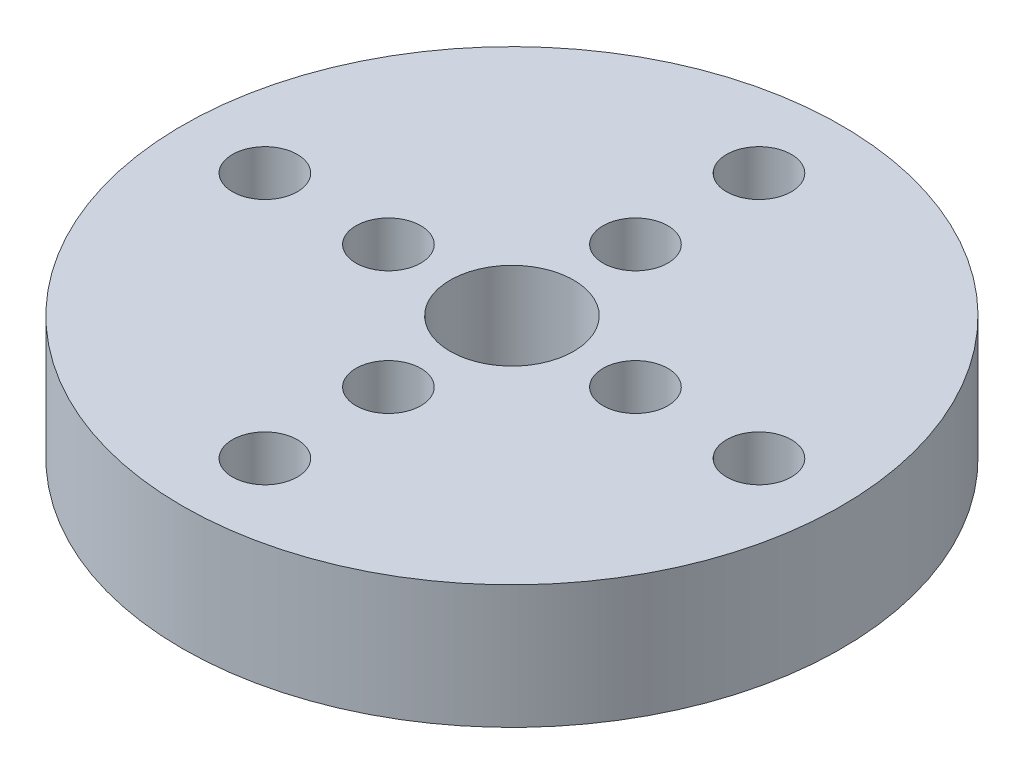
ISO-10303-21;
HEADER;
FILE_DESCRIPTION(('STEP AP214'),'2;1');
FILE_NAME('part.step','',(''),(''),'','','');
FILE_SCHEMA(('AUTOMOTIVE_DESIGN { 1 0 10303 214 1 1 1 1 }'));
ENDSEC;
DATA;
#1=APPLICATION_CONTEXT('core data for automotive mechanical design processes');
#2=APPLICATION_PROTOCOL_DEFINITION('international standard','automotive_design',2000,#1);
#3=PRODUCT_CONTEXT('',#1,'mechanical');
#4=PRODUCT('Part','Part','',(#3));
#5=PRODUCT_RELATED_PRODUCT_CATEGORY('part','',(#4));
#6=PRODUCT_DEFINITION_FORMATION('','',#4);
#7=PRODUCT_DEFINITION_CONTEXT('part definition',#1,'design');
#8=PRODUCT_DEFINITION('design','',#6,#7);
#9=PRODUCT_DEFINITION_SHAPE('','',#8);
#10=(LENGTH_UNIT() NAMED_UNIT(*) SI_UNIT(.MILLI.,.METRE.));
#11=(NAMED_UNIT(*) PLANE_ANGLE_UNIT() SI_UNIT($,.RADIAN.));
#12=(NAMED_UNIT(*) SI_UNIT($,.STERADIAN.) SOLID_ANGLE_UNIT());
#13=UNCERTAINTY_MEASURE_WITH_UNIT(LENGTH_MEASURE(1.E-05),#10,'distance_accuracy_value','');
#14=(GEOMETRIC_REPRESENTATION_CONTEXT(3) GLOBAL_UNCERTAINTY_ASSIGNED_CONTEXT((#13)) GLOBAL_UNIT_ASSIGNED_CONTEXT((#10,
#11,#12)) REPRESENTATION_CONTEXT('',''));
#15=CARTESIAN_POINT('',(0.,0.,0.));
#16=DIRECTION('',(0.,0.,1.));
#17=DIRECTION('',(1.,0.,0.));
#18=AXIS2_PLACEMENT_3D('',#15,#16,#17);
#19=CARTESIAN_POINT('',(0.,8.,0.));
#20=DIRECTION('',(0.,-1.,0.));
#21=DIRECTION('',(0.,0.,-1.));
#22=AXIS2_PLACEMENT_3D('',#19,#20,#21);
#23=CYLINDRICAL_SURFACE('',#22,21.345);
#24=CARTESIAN_POINT('',(0.,8.,0.));
#25=DIRECTION('',(0.,1.,0.));
#26=DIRECTION('',(0.,0.,1.));
#27=AXIS2_PLACEMENT_3D('',#24,#25,#26);
#28=CIRCLE('',#27,21.345);
#29=CARTESIAN_POINT('',(0.,8.,21.345));
#30=VERTEX_POINT('',#29);
#31=EDGE_CURVE('E10',#30,#30,#28,.T.);
#32=ORIENTED_EDGE('',*,*,#31,.F.);
#33=EDGE_LOOP('',(#32));
#34=FACE_BOUND('',#33,.T.);
#35=CARTESIAN_POINT('',(0.,0.,0.));
#36=DIRECTION('',(0.,1.,0.));
#37=DIRECTION('',(0.,0.,1.));
#38=AXIS2_PLACEMENT_3D('',#35,#36,#37);
#39=CIRCLE('',#38,21.345);
#40=CARTESIAN_POINT('',(0.,0.,21.345));
#41=VERTEX_POINT('',#40);
#42=EDGE_CURVE('E33',#41,#41,#39,.T.);
#43=ORIENTED_EDGE('',*,*,#42,.T.);
#44=EDGE_LOOP('',(#43));
#45=FACE_BOUND('',#44,.T.);
#46=ADVANCED_FACE('F30',(#34,#45),#23,.T.);
#47=CARTESIAN_POINT('',(0.,8.,0.));
#48=DIRECTION('',(0.,1.,0.));
#49=DIRECTION('',(0.,0.,1.));
#50=AXIS2_PLACEMENT_3D('',#47,#48,#49);
#51=PLANE('',#50);
#52=CARTESIAN_POINT('',(0.,8.,16.));
#53=DIRECTION('',(0.,1.,0.));
#54=DIRECTION('',(0.,0.,1.));
#55=AXIS2_PLACEMENT_3D('',#52,#53,#54);
#56=CIRCLE('',#55,2.1);
#57=CARTESIAN_POINT('',(0.,8.,18.1));
#58=VERTEX_POINT('',#57);
#59=EDGE_CURVE('E90',#58,#58,#56,.T.);
#60=ORIENTED_EDGE('',*,*,#59,.F.);
#61=EDGE_LOOP('',(#60));
#62=FACE_BOUND('',#61,.T.);
#63=CARTESIAN_POINT('',(0.,8.,8.));
#64=DIRECTION('',(0.,1.,0.));
#65=DIRECTION('',(0.,0.,1.));
#66=AXIS2_PLACEMENT_3D('',#63,#64,#65);
#67=CIRCLE('',#66,2.1);
#68=CARTESIAN_POINT('',(0.,8.,10.1));
#69=VERTEX_POINT('',#68);
#70=EDGE_CURVE('E84',#69,#69,#67,.T.);
#71=ORIENTED_EDGE('',*,*,#70,.F.);
#72=EDGE_LOOP('',(#71));
#73=FACE_BOUND('',#72,.T.);
#74=CARTESIAN_POINT('',(-16.,8.,0.));
#75=DIRECTION('',(0.,1.,0.));
#76=DIRECTION('',(0.,0.,1.));
#77=AXIS2_PLACEMENT_3D('',#74,#75,#76);
#78=CIRCLE('',#77,2.1);
#79=CARTESIAN_POINT('',(-16.,8.,2.1));
#80=VERTEX_POINT('',#79);
#81=EDGE_CURVE('E78',#80,#80,#78,.T.);
#82=ORIENTED_EDGE('',*,*,#81,.F.);
#83=EDGE_LOOP('',(#82));
#84=FACE_BOUND('',#83,.T.);
#85=CARTESIAN_POINT('',(-8.,8.,0.));
#86=DIRECTION('',(0.,1.,0.));
#87=DIRECTION('',(0.,0.,1.));
#88=AXIS2_PLACEMENT_3D('',#85,#86,#87);
#89=CIRCLE('',#88,2.1);
#90=CARTESIAN_POINT('',(-8.,8.,2.1));
#91=VERTEX_POINT('',#90);
#92=EDGE_CURVE('E72',#91,#91,#89,.T.);
#93=ORIENTED_EDGE('',*,*,#92,.F.);
#94=EDGE_LOOP('',(#93));
#95=FACE_BOUND('',#94,.T.);
#96=CARTESIAN_POINT('',(8.,8.,0.));
#97=DIRECTION('',(0.,1.,0.));
#98=DIRECTION('',(0.,0.,1.));
#99=AXIS2_PLACEMENT_3D('',#96,#97,#98);
#100=CIRCLE('',#99,2.1);
#101=CARTESIAN_POINT('',(8.,8.,2.1));
#102=VERTEX_POINT('',#101);
#103=EDGE_CURVE('E66',#102,#102,#100,.T.);
#104=ORIENTED_EDGE('',*,*,#103,.F.);
#105=EDGE_LOOP('',(#104));
#106=FACE_BOUND('',#105,.T.);
#107=CARTESIAN_POINT('',(16.,8.,0.));
#108=DIRECTION('',(0.,1.,0.));
#109=DIRECTION('',(0.,0.,1.));
#110=AXIS2_PLACEMENT_3D('',#107,#108,#109);
#111=CIRCLE('',#110,2.1);
#112=CARTESIAN_POINT('',(16.,8.,2.1));
#113=VERTEX_POINT('',#112);
#114=EDGE_CURVE('E60',#113,#113,#111,.T.);
#115=ORIENTED_EDGE('',*,*,#114,.F.);
#116=EDGE_LOOP('',(#115));
#117=FACE_BOUND('',#116,.T.);
#118=CARTESIAN_POINT('',(0.,8.,-16.));
#119=DIRECTION('',(0.,1.,0.));
#120=DIRECTION('',(0.,0.,1.));
#121=AXIS2_PLACEMENT_3D('',#118,#119,#120);
#122=CIRCLE('',#121,2.1);
#123=CARTESIAN_POINT('',(0.,8.,-13.9));
#124=VERTEX_POINT('',#123);
#125=EDGE_CURVE('E54',#124,#124,#122,.T.);
#126=ORIENTED_EDGE('',*,*,#125,.F.);
#127=EDGE_LOOP('',(#126));
#128=FACE_BOUND('',#127,.T.);
#129=CARTESIAN_POINT('',(0.,8.,-8.));
#130=DIRECTION('',(0.,1.,0.));
#131=DIRECTION('',(0.,0.,1.));
#132=AXIS2_PLACEMENT_3D('',#129,#130,#131);
#133=CIRCLE('',#132,2.1);
#134=CARTESIAN_POINT('',(0.,8.,-5.9));
#135=VERTEX_POINT('',#134);
#136=EDGE_CURVE('E48',#135,#135,#133,.T.);
#137=ORIENTED_EDGE('',*,*,#136,.F.);
#138=EDGE_LOOP('',(#137));
#139=FACE_BOUND('',#138,.T.);
#140=CARTESIAN_POINT('',(0.,8.,0.));
#141=DIRECTION('',(0.,1.,0.));
#142=DIRECTION('',(0.,0.,1.));
#143=AXIS2_PLACEMENT_3D('',#140,#141,#142);
#144=CIRCLE('',#143,4.);
#145=CARTESIAN_POINT('',(0.,8.,4.));
#146=VERTEX_POINT('',#145);
#147=EDGE_CURVE('E42',#146,#146,#144,.T.);
#148=ORIENTED_EDGE('',*,*,#147,.F.);
#149=EDGE_LOOP('',(#148));
#150=FACE_BOUND('',#149,.T.);
#151=ORIENTED_EDGE('',*,*,#31,.T.);
#152=EDGE_LOOP('',(#151));
#153=FACE_BOUND('',#152,.T.);
#154=ADVANCED_FACE('F106',(#62,#73,#84,#95,#106,#117,#128,#139,#150,#153),#51,.T.);
#155=CARTESIAN_POINT('',(0.,0.,0.));
#156=DIRECTION('',(0.,1.,0.));
#157=DIRECTION('',(0.,0.,1.));
#158=AXIS2_PLACEMENT_3D('',#155,#156,#157);
#159=PLANE('',#158);
#160=CARTESIAN_POINT('',(0.,0.,16.));
#161=DIRECTION('',(0.,1.,0.));
#162=DIRECTION('',(0.,0.,1.));
#163=AXIS2_PLACEMENT_3D('',#160,#161,#162);
#164=CIRCLE('',#163,2.1);
#165=CARTESIAN_POINT('',(0.,0.,18.1));
#166=VERTEX_POINT('',#165);
#167=EDGE_CURVE('E87',#166,#166,#164,.T.);
#168=ORIENTED_EDGE('',*,*,#167,.T.);
#169=EDGE_LOOP('',(#168));
#170=FACE_BOUND('',#169,.T.);
#171=CARTESIAN_POINT('',(0.,0.,8.));
#172=DIRECTION('',(0.,1.,0.));
#173=DIRECTION('',(0.,0.,1.));
#174=AXIS2_PLACEMENT_3D('',#171,#172,#173);
#175=CIRCLE('',#174,2.1);
#176=CARTESIAN_POINT('',(0.,0.,10.1));
#177=VERTEX_POINT('',#176);
#178=EDGE_CURVE('E81',#177,#177,#175,.T.);
#179=ORIENTED_EDGE('',*,*,#178,.T.);
#180=EDGE_LOOP('',(#179));
#181=FACE_BOUND('',#180,.T.);
#182=CARTESIAN_POINT('',(-16.,0.,0.));
#183=DIRECTION('',(0.,1.,0.));
#184=DIRECTION('',(0.,0.,1.));
#185=AXIS2_PLACEMENT_3D('',#182,#183,#184);
#186=CIRCLE('',#185,2.1);
#187=CARTESIAN_POINT('',(-16.,0.,2.1));
#188=VERTEX_POINT('',#187);
#189=EDGE_CURVE('E75',#188,#188,#186,.T.);
#190=ORIENTED_EDGE('',*,*,#189,.T.);
#191=EDGE_LOOP('',(#190));
#192=FACE_BOUND('',#191,.T.);
#193=CARTESIAN_POINT('',(-8.,0.,0.));
#194=DIRECTION('',(0.,1.,0.));
#195=DIRECTION('',(0.,0.,1.));
#196=AXIS2_PLACEMENT_3D('',#193,#194,#195);
#197=CIRCLE('',#196,2.1);
#198=CARTESIAN_POINT('',(-8.,0.,2.1));
#199=VERTEX_POINT('',#198);
#200=EDGE_CURVE('E69',#199,#199,#197,.T.);
#201=ORIENTED_EDGE('',*,*,#200,.T.);
#202=EDGE_LOOP('',(#201));
#203=FACE_BOUND('',#202,.T.);
#204=CARTESIAN_POINT('',(8.,0.,0.));
#205=DIRECTION('',(0.,1.,0.));
#206=DIRECTION('',(0.,0.,1.));
#207=AXIS2_PLACEMENT_3D('',#204,#205,#206);
#208=CIRCLE('',#207,2.1);
#209=CARTESIAN_POINT('',(8.,0.,2.1));
#210=VERTEX_POINT('',#209);
#211=EDGE_CURVE('E63',#210,#210,#208,.T.);
#212=ORIENTED_EDGE('',*,*,#211,.T.);
#213=EDGE_LOOP('',(#212));
#214=FACE_BOUND('',#213,.T.);
#215=CARTESIAN_POINT('',(16.,0.,0.));
#216=DIRECTION('',(0.,1.,0.));
#217=DIRECTION('',(0.,0.,1.));
#218=AXIS2_PLACEMENT_3D('',#215,#216,#217);
#219=CIRCLE('',#218,2.1);
#220=CARTESIAN_POINT('',(16.,0.,2.1));
#221=VERTEX_POINT('',#220);
#222=EDGE_CURVE('E57',#221,#221,#219,.T.);
#223=ORIENTED_EDGE('',*,*,#222,.T.);
#224=EDGE_LOOP('',(#223));
#225=FACE_BOUND('',#224,.T.);
#226=CARTESIAN_POINT('',(0.,0.,-16.));
#227=DIRECTION('',(0.,1.,0.));
#228=DIRECTION('',(0.,0.,1.));
#229=AXIS2_PLACEMENT_3D('',#226,#227,#228);
#230=CIRCLE('',#229,2.1);
#231=CARTESIAN_POINT('',(0.,0.,-13.9));
#232=VERTEX_POINT('',#231);
#233=EDGE_CURVE('E51',#232,#232,#230,.T.);
#234=ORIENTED_EDGE('',*,*,#233,.T.);
#235=EDGE_LOOP('',(#234));
#236=FACE_BOUND('',#235,.T.);
#237=CARTESIAN_POINT('',(0.,0.,-8.));
#238=DIRECTION('',(0.,1.,0.));
#239=DIRECTION('',(0.,0.,1.));
#240=AXIS2_PLACEMENT_3D('',#237,#238,#239);
#241=CIRCLE('',#240,2.1);
#242=CARTESIAN_POINT('',(0.,0.,-5.9));
#243=VERTEX_POINT('',#242);
#244=EDGE_CURVE('E45',#243,#243,#241,.T.);
#245=ORIENTED_EDGE('',*,*,#244,.T.);
#246=EDGE_LOOP('',(#245));
#247=FACE_BOUND('',#246,.T.);
#248=CARTESIAN_POINT('',(0.,0.,0.));
#249=DIRECTION('',(0.,1.,0.));
#250=DIRECTION('',(0.,0.,1.));
#251=AXIS2_PLACEMENT_3D('',#248,#249,#250);
#252=CIRCLE('',#251,4.);
#253=CARTESIAN_POINT('',(0.,0.,4.));
#254=VERTEX_POINT('',#253);
#255=EDGE_CURVE('E40',#254,#254,#252,.T.);
#256=ORIENTED_EDGE('',*,*,#255,.T.);
#257=EDGE_LOOP('',(#256));
#258=FACE_BOUND('',#257,.T.);
#259=ORIENTED_EDGE('',*,*,#42,.F.);
#260=EDGE_LOOP('',(#259));
#261=FACE_BOUND('',#260,.T.);
#262=ADVANCED_FACE('F96',(#170,#181,#192,#203,#214,#225,#236,#247,#258,#261),#159,.F.);
#263=CARTESIAN_POINT('',(0.,0.,0.));
#264=DIRECTION('',(0.,1.,0.));
#265=DIRECTION('',(0.,0.,1.));
#266=AXIS2_PLACEMENT_3D('',#263,#264,#265);
#267=CYLINDRICAL_SURFACE('',#266,4.);
#268=ORIENTED_EDGE('',*,*,#255,.F.);
#269=EDGE_LOOP('',(#268));
#270=FACE_BOUND('',#269,.T.);
#271=ORIENTED_EDGE('',*,*,#147,.T.);
#272=EDGE_LOOP('',(#271));
#273=FACE_BOUND('',#272,.T.);
#274=ADVANCED_FACE('F126',(#270,#273),#267,.F.);
#275=CARTESIAN_POINT('',(0.,0.,-8.));
#276=DIRECTION('',(0.,1.,0.));
#277=DIRECTION('',(0.,0.,1.));
#278=AXIS2_PLACEMENT_3D('',#275,#276,#277);
#279=CYLINDRICAL_SURFACE('',#278,2.1);
#280=ORIENTED_EDGE('',*,*,#244,.F.);
#281=EDGE_LOOP('',(#280));
#282=FACE_BOUND('',#281,.T.);
#283=ORIENTED_EDGE('',*,*,#136,.T.);
#284=EDGE_LOOP('',(#283));
#285=FACE_BOUND('',#284,.T.);
#286=ADVANCED_FACE('F128',(#282,#285),#279,.F.);
#287=CARTESIAN_POINT('',(0.,0.,-16.));
#288=DIRECTION('',(0.,1.,0.));
#289=DIRECTION('',(0.,0.,1.));
#290=AXIS2_PLACEMENT_3D('',#287,#288,#289);
#291=CYLINDRICAL_SURFACE('',#290,2.1);
#292=ORIENTED_EDGE('',*,*,#233,.F.);
#293=EDGE_LOOP('',(#292));
#294=FACE_BOUND('',#293,.T.);
#295=ORIENTED_EDGE('',*,*,#125,.T.);
#296=EDGE_LOOP('',(#295));
#297=FACE_BOUND('',#296,.T.);
#298=ADVANCED_FACE('F135',(#294,#297),#291,.F.);
#299=CARTESIAN_POINT('',(16.,0.,0.));
#300=DIRECTION('',(0.,1.,0.));
#301=DIRECTION('',(0.,0.,1.));
#302=AXIS2_PLACEMENT_3D('',#299,#300,#301);
#303=CYLINDRICAL_SURFACE('',#302,2.1);
#304=ORIENTED_EDGE('',*,*,#222,.F.);
#305=EDGE_LOOP('',(#304));
#306=FACE_BOUND('',#305,.T.);
#307=ORIENTED_EDGE('',*,*,#114,.T.);
#308=EDGE_LOOP('',(#307));
#309=FACE_BOUND('',#308,.T.);
#310=ADVANCED_FACE('F170',(#306,#309),#303,.F.);
#311=CARTESIAN_POINT('',(8.,0.,0.));
#312=DIRECTION('',(0.,1.,0.));
#313=DIRECTION('',(0.,0.,1.));
#314=AXIS2_PLACEMENT_3D('',#311,#312,#313);
#315=CYLINDRICAL_SURFACE('',#314,2.1);
#316=ORIENTED_EDGE('',*,*,#211,.F.);
#317=EDGE_LOOP('',(#316));
#318=FACE_BOUND('',#317,.T.);
#319=ORIENTED_EDGE('',*,*,#103,.T.);
#320=EDGE_LOOP('',(#319));
#321=FACE_BOUND('',#320,.T.);
#322=ADVANCED_FACE('F180',(#318,#321),#315,.F.);
#323=CARTESIAN_POINT('',(-8.,0.,0.));
#324=DIRECTION('',(0.,1.,0.));
#325=DIRECTION('',(0.,0.,1.));
#326=AXIS2_PLACEMENT_3D('',#323,#324,#325);
#327=CYLINDRICAL_SURFACE('',#326,2.1);
#328=ORIENTED_EDGE('',*,*,#200,.F.);
#329=EDGE_LOOP('',(#328));
#330=FACE_BOUND('',#329,.T.);
#331=ORIENTED_EDGE('',*,*,#92,.T.);
#332=EDGE_LOOP('',(#331));
#333=FACE_BOUND('',#332,.T.);
#334=ADVANCED_FACE('F190',(#330,#333),#327,.F.);
#335=CARTESIAN_POINT('',(-16.,0.,0.));
#336=DIRECTION('',(0.,1.,0.));
#337=DIRECTION('',(0.,0.,1.));
#338=AXIS2_PLACEMENT_3D('',#335,#336,#337);
#339=CYLINDRICAL_SURFACE('',#338,2.1);
#340=ORIENTED_EDGE('',*,*,#189,.F.);
#341=EDGE_LOOP('',(#340));
#342=FACE_BOUND('',#341,.T.);
#343=ORIENTED_EDGE('',*,*,#81,.T.);
#344=EDGE_LOOP('',(#343));
#345=FACE_BOUND('',#344,.T.);
#346=ADVANCED_FACE('F200',(#342,#345),#339,.F.);
#347=CARTESIAN_POINT('',(0.,0.,8.));
#348=DIRECTION('',(0.,1.,0.));
#349=DIRECTION('',(0.,0.,1.));
#350=AXIS2_PLACEMENT_3D('',#347,#348,#349);
#351=CYLINDRICAL_SURFACE('',#350,2.1);
#352=ORIENTED_EDGE('',*,*,#178,.F.);
#353=EDGE_LOOP('',(#352));
#354=FACE_BOUND('',#353,.T.);
#355=ORIENTED_EDGE('',*,*,#70,.T.);
#356=EDGE_LOOP('',(#355));
#357=FACE_BOUND('',#356,.T.);
#358=ADVANCED_FACE('F102',(#354,#357),#351,.F.);
#359=CARTESIAN_POINT('',(0.,0.,16.));
#360=DIRECTION('',(0.,1.,0.));
#361=DIRECTION('',(0.,0.,1.));
#362=AXIS2_PLACEMENT_3D('',#359,#360,#361);
#363=CYLINDRICAL_SURFACE('',#362,2.1);
#364=ORIENTED_EDGE('',*,*,#167,.F.);
#365=EDGE_LOOP('',(#364));
#366=FACE_BOUND('',#365,.T.);
#367=ORIENTED_EDGE('',*,*,#59,.T.);
#368=EDGE_LOOP('',(#367));
#369=FACE_BOUND('',#368,.T.);
#370=ADVANCED_FACE('F99',(#366,#369),#363,.F.);
#371=CLOSED_SHELL('',(#46,#154,#262,#274,#286,#298,#310,#322,#334,#346,#358,#370));
#372=MANIFOLD_SOLID_BREP('B2',#371);
#373=ADVANCED_BREP_SHAPE_REPRESENTATION('',(#18,#372),#14);
#374=SHAPE_DEFINITION_REPRESENTATION(#9,#373);
ENDSEC;
END-ISO-10303-21;
